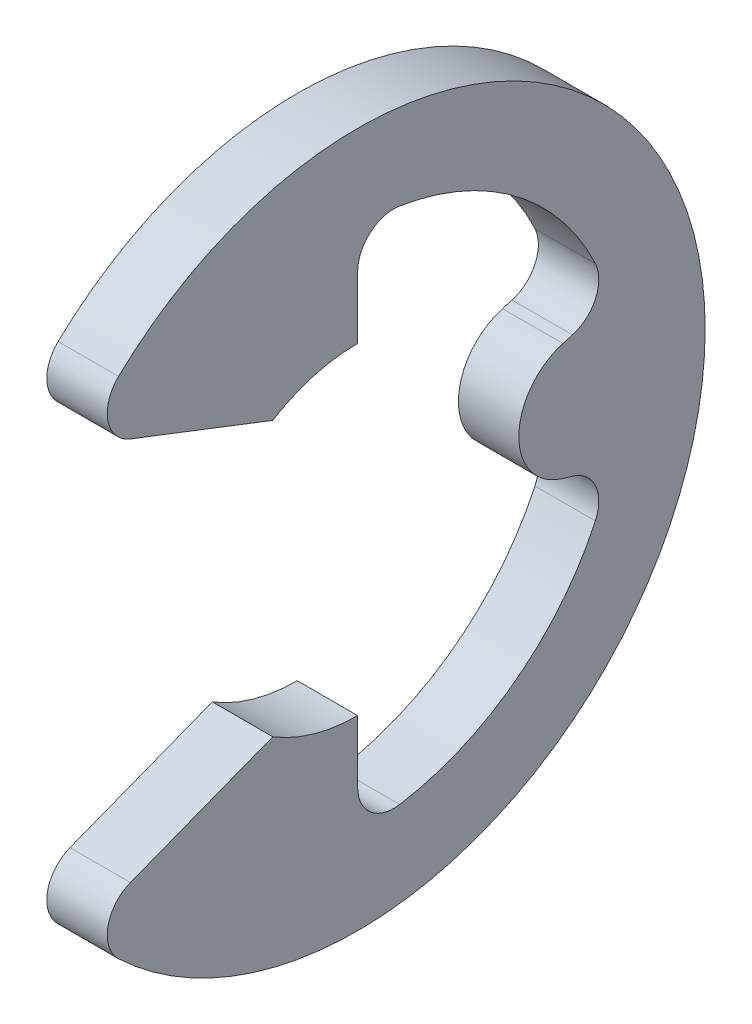
ISO-10303-21;
HEADER;
FILE_DESCRIPTION(('STEP AP214'),'2;1');
FILE_NAME('part.step','',(''),(''),'','','');
FILE_SCHEMA(('AUTOMOTIVE_DESIGN { 1 0 10303 214 1 1 1 1 }'));
ENDSEC;
DATA;
#1=APPLICATION_CONTEXT('core data for automotive mechanical design processes');
#2=APPLICATION_PROTOCOL_DEFINITION('international standard','automotive_design',2000,#1);
#3=PRODUCT_CONTEXT('',#1,'mechanical');
#4=PRODUCT('Part','Part','',(#3));
#5=PRODUCT_RELATED_PRODUCT_CATEGORY('part','',(#4));
#6=PRODUCT_DEFINITION_FORMATION('','',#4);
#7=PRODUCT_DEFINITION_CONTEXT('part definition',#1,'design');
#8=PRODUCT_DEFINITION('design','',#6,#7);
#9=PRODUCT_DEFINITION_SHAPE('','',#8);
#10=(LENGTH_UNIT() NAMED_UNIT(*) SI_UNIT(.MILLI.,.METRE.));
#11=(NAMED_UNIT(*) PLANE_ANGLE_UNIT() SI_UNIT($,.RADIAN.));
#12=(NAMED_UNIT(*) SI_UNIT($,.STERADIAN.) SOLID_ANGLE_UNIT());
#13=UNCERTAINTY_MEASURE_WITH_UNIT(LENGTH_MEASURE(1.E-05),#10,'distance_accuracy_value','');
#14=(GEOMETRIC_REPRESENTATION_CONTEXT(3) GLOBAL_UNCERTAINTY_ASSIGNED_CONTEXT((#13)) GLOBAL_UNIT_ASSIGNED_CONTEXT((#10,
#11,#12)) REPRESENTATION_CONTEXT('',''));
#15=CARTESIAN_POINT('',(0.,0.,0.));
#16=DIRECTION('',(0.,0.,1.));
#17=DIRECTION('',(1.,0.,0.));
#18=AXIS2_PLACEMENT_3D('',#15,#16,#17);
#19=CARTESIAN_POINT('',(0.3,0.,0.));
#20=DIRECTION('',(1.,0.,0.));
#21=DIRECTION('',(0.,0.,-1.));
#22=AXIS2_PLACEMENT_3D('',#19,#20,#21);
#23=PLANE('',#22);
#24=CARTESIAN_POINT('',(0.3,0.,-2.20343572540988));
#25=DIRECTION('',(1.,0.,0.));
#26=DIRECTION('',(0.,0.,-1.));
#27=AXIS2_PLACEMENT_3D('',#24,#25,#26);
#28=CIRCLE('',#27,0.603435725409875);
#29=CARTESIAN_POINT('',(0.3,0.58036589673961,-2.03817804600414));
#30=VERTEX_POINT('',#29);
#31=CARTESIAN_POINT('',(0.3,-0.580365896739609,-2.03817804600414));
#32=VERTEX_POINT('',#31);
#33=EDGE_CURVE('E192',#30,#32,#28,.T.);
#34=ORIENTED_EDGE('',*,*,#33,.T.);
#35=DIRECTION('',(0.,-0.273861278752584,-0.961769203083567));
#36=VECTOR('',#35,1.);
#37=CARTESIAN_POINT('',(0.3,-0.438178046004132,-1.53883072493371));
#38=LINE('',#37,#36);
#39=CARTESIAN_POINT('',(0.3,-0.607265068716835,-2.13264483340097));
#40=VERTEX_POINT('',#39);
#41=EDGE_CURVE('E93',#32,#40,#38,.T.);
#42=ORIENTED_EDGE('',*,*,#41,.T.);
#43=CARTESIAN_POINT('',(0.3,-0.953501981826919,-2.03405477305004));
#44=DIRECTION('',(1.,0.,0.));
#45=DIRECTION('',(0.,0.,-1.));
#46=AXIS2_PLACEMENT_3D('',#43,#44,#45);
#47=CIRCLE('',#46,0.36);
#48=CARTESIAN_POINT('',(0.3,-1.10630327587041,-2.36001759997764));
#49=VERTEX_POINT('',#48);
#50=EDGE_CURVE('E312',#40,#49,#47,.F.);
#51=ORIENTED_EDGE('',*,*,#50,.T.);
#52=CARTESIAN_POINT('',(0.3,0.,0.));
#53=DIRECTION('',(-1.,0.,0.));
#54=DIRECTION('',(0.,0.,-1.));
#55=AXIS2_PLACEMENT_3D('',#52,#53,#54);
#56=CIRCLE('',#55,2.60645161290323);
#57=CARTESIAN_POINT('',(0.3,-2.57276587621173,-0.41769098219414));
#58=VERTEX_POINT('',#57);
#59=EDGE_CURVE('E208',#49,#58,#56,.T.);
#60=ORIENTED_EDGE('',*,*,#59,.T.);
#61=CARTESIAN_POINT('',(0.3,-2.2174185101409,-0.359999999999999));
#62=DIRECTION('',(1.,0.,0.));
#63=DIRECTION('',(0.,0.,-1.));
#64=AXIS2_PLACEMENT_3D('',#61,#62,#63);
#65=CIRCLE('',#64,0.36);
#66=CARTESIAN_POINT('',(0.3,-2.2174185101409,0.));
#67=VERTEX_POINT('',#66);
#68=EDGE_CURVE('E303',#58,#67,#65,.F.);
#69=ORIENTED_EDGE('',*,*,#68,.T.);
#70=DIRECTION('',(0.,1.,0.));
#71=VECTOR('',#70,1.);
#72=CARTESIAN_POINT('',(0.3,-1.6,0.));
#73=LINE('',#72,#71);
#74=CARTESIAN_POINT('',(0.3,-1.6,0.));
#75=VERTEX_POINT('',#74);
#76=EDGE_CURVE('E211',#67,#75,#73,.T.);
#77=ORIENTED_EDGE('',*,*,#76,.T.);
#78=CARTESIAN_POINT('',(0.3,0.,0.));
#79=DIRECTION('',(-1.,0.,0.));
#80=DIRECTION('',(0.,0.,-1.));
#81=AXIS2_PLACEMENT_3D('',#78,#79,#80);
#82=CIRCLE('',#81,1.6);
#83=CARTESIAN_POINT('',(0.3,-1.36,0.84285230022822));
#84=VERTEX_POINT('',#83);
#85=EDGE_CURVE('E218',#75,#84,#82,.T.);
#86=ORIENTED_EDGE('',*,*,#85,.T.);
#87=DIRECTION('',(0.,-0.360953284628375,0.932583897735741));
#88=VECTOR('',#87,1.);
#89=CARTESIAN_POINT('',(0.3,-2.09476781896279,2.74124931092338));
#90=LINE('',#89,#88);
#91=CARTESIAN_POINT('',(0.3,-1.9068472002673,2.25572458927308));
#92=VERTEX_POINT('',#91);
#93=EDGE_CURVE('E220',#84,#92,#90,.T.);
#94=ORIENTED_EDGE('',*,*,#93,.T.);
#95=CARTESIAN_POINT('',(0.3,-2.24257740345216,2.12578140680686));
#96=DIRECTION('',(1.,0.,0.));
#97=DIRECTION('',(0.,0.,-1.));
#98=AXIS2_PLACEMENT_3D('',#95,#96,#97);
#99=CIRCLE('',#98,0.36);
#100=CARTESIAN_POINT('',(0.3,-2.50384855725241,2.37344526002708));
#101=VERTEX_POINT('',#100);
#102=EDGE_CURVE('E292',#92,#101,#99,.T.);
#103=ORIENTED_EDGE('',*,*,#102,.T.);
#104=CARTESIAN_POINT('',(0.3,0.,0.));
#105=DIRECTION('',(1.,0.,0.));
#106=DIRECTION('',(0.,0.,-1.));
#107=AXIS2_PLACEMENT_3D('',#104,#105,#106);
#108=CIRCLE('',#107,3.45);
#109=CARTESIAN_POINT('',(0.3,2.50384855725241,2.37344526002708));
#110=VERTEX_POINT('',#109);
#111=EDGE_CURVE('E252',#101,#110,#108,.T.);
#112=ORIENTED_EDGE('',*,*,#111,.T.);
#113=CARTESIAN_POINT('',(0.3,2.24257740345216,2.12578140680686));
#114=DIRECTION('',(1.,0.,0.));
#115=DIRECTION('',(0.,0.,-1.));
#116=AXIS2_PLACEMENT_3D('',#113,#114,#115);
#117=CIRCLE('',#116,0.36);
#118=CARTESIAN_POINT('',(0.3,1.9068472002673,2.25572458927308));
#119=VERTEX_POINT('',#118);
#120=EDGE_CURVE('E290',#110,#119,#117,.T.);
#121=ORIENTED_EDGE('',*,*,#120,.T.);
#122=DIRECTION('',(0.,-0.360953284628375,-0.932583897735741));
#123=VECTOR('',#122,1.);
#124=CARTESIAN_POINT('',(0.3,2.09476781896279,2.74124931092338));
#125=LINE('',#124,#123);
#126=CARTESIAN_POINT('',(0.3,1.36,0.84285230022822));
#127=VERTEX_POINT('',#126);
#128=EDGE_CURVE('E333',#119,#127,#125,.T.);
#129=ORIENTED_EDGE('',*,*,#128,.T.);
#130=CARTESIAN_POINT('',(0.3,0.,0.));
#131=DIRECTION('',(-1.,0.,0.));
#132=DIRECTION('',(0.,0.,1.));
#133=AXIS2_PLACEMENT_3D('',#130,#131,#132);
#134=CIRCLE('',#133,1.6);
#135=CARTESIAN_POINT('',(0.3,1.6,0.));
#136=VERTEX_POINT('',#135);
#137=EDGE_CURVE('E335',#127,#136,#134,.T.);
#138=ORIENTED_EDGE('',*,*,#137,.T.);
#139=DIRECTION('',(0.,1.,0.));
#140=VECTOR('',#139,1.);
#141=CARTESIAN_POINT('',(0.3,1.6,0.));
#142=LINE('',#141,#140);
#143=CARTESIAN_POINT('',(0.3,2.2174185101409,0.));
#144=VERTEX_POINT('',#143);
#145=EDGE_CURVE('E337',#136,#144,#142,.T.);
#146=ORIENTED_EDGE('',*,*,#145,.T.);
#147=CARTESIAN_POINT('',(0.3,2.2174185101409,-0.359999999999998));
#148=DIRECTION('',(1.,0.,0.));
#149=DIRECTION('',(0.,0.,-1.));
#150=AXIS2_PLACEMENT_3D('',#147,#148,#149);
#151=CIRCLE('',#150,0.36);
#152=CARTESIAN_POINT('',(0.3,2.57276587621173,-0.417690982194139));
#153=VERTEX_POINT('',#152);
#154=EDGE_CURVE('E307',#144,#153,#151,.F.);
#155=ORIENTED_EDGE('',*,*,#154,.T.);
#156=CARTESIAN_POINT('',(0.3,0.,0.));
#157=DIRECTION('',(-1.,0.,0.));
#158=DIRECTION('',(0.,0.,-1.));
#159=AXIS2_PLACEMENT_3D('',#156,#157,#158);
#160=CIRCLE('',#159,2.60645161290323);
#161=CARTESIAN_POINT('',(0.3,1.10630327587041,-2.36001759997764));
#162=VERTEX_POINT('',#161);
#163=EDGE_CURVE('E213',#153,#162,#160,.T.);
#164=ORIENTED_EDGE('',*,*,#163,.T.);
#165=CARTESIAN_POINT('',(0.3,0.95350198182692,-2.03405477305004));
#166=DIRECTION('',(1.,0.,0.));
#167=DIRECTION('',(0.,0.,-1.));
#168=AXIS2_PLACEMENT_3D('',#165,#166,#167);
#169=CIRCLE('',#168,0.36);
#170=CARTESIAN_POINT('',(0.3,0.607265068716836,-2.13264483340097));
#171=VERTEX_POINT('',#170);
#172=EDGE_CURVE('E12',#162,#171,#169,.F.);
#173=ORIENTED_EDGE('',*,*,#172,.T.);
#174=DIRECTION('',(0.,-0.273861278752584,0.961769203083567));
#175=VECTOR('',#174,1.);
#176=CARTESIAN_POINT('',(0.3,0.438178046004133,-1.53883072493371));
#177=LINE('',#176,#175);
#178=EDGE_CURVE('E195',#171,#30,#177,.T.);
#179=ORIENTED_EDGE('',*,*,#178,.T.);
#180=EDGE_LOOP('',(#34,#42,#51,#60,#69,#77,#86,#94,#103,#112,#121,#129,#138,#146,#155,#164,#173,#179));
#181=FACE_BOUND('',#180,.T.);
#182=ADVANCED_FACE('F70',(#181),#23,.T.);
#183=CARTESIAN_POINT('',(-0.3,0.,0.));
#184=DIRECTION('',(1.,0.,0.));
#185=DIRECTION('',(0.,0.,-1.));
#186=AXIS2_PLACEMENT_3D('',#183,#184,#185);
#187=PLANE('',#186);
#188=DIRECTION('',(0.,-0.273861278752584,-0.961769203083567));
#189=VECTOR('',#188,1.);
#190=CARTESIAN_POINT('',(-0.3,-0.438178046004132,-1.53883072493371));
#191=LINE('',#190,#189);
#192=CARTESIAN_POINT('',(-0.3,-0.580365896739609,-2.03817804600414));
#193=VERTEX_POINT('',#192);
#194=CARTESIAN_POINT('',(-0.3,-0.607265068716835,-2.13264483340097));
#195=VERTEX_POINT('',#194);
#196=EDGE_CURVE('E240',#193,#195,#191,.T.);
#197=ORIENTED_EDGE('',*,*,#196,.F.);
#198=CARTESIAN_POINT('',(-0.3,0.,-2.20343572540988));
#199=DIRECTION('',(1.,0.,0.));
#200=DIRECTION('',(0.,0.,-1.));
#201=AXIS2_PLACEMENT_3D('',#198,#199,#200);
#202=CIRCLE('',#201,0.603435725409875);
#203=CARTESIAN_POINT('',(-0.3,0.580365896739609,-2.03817804600414));
#204=VERTEX_POINT('',#203);
#205=EDGE_CURVE('E196',#204,#193,#202,.T.);
#206=ORIENTED_EDGE('',*,*,#205,.F.);
#207=DIRECTION('',(0.,-0.273861278752584,0.961769203083567));
#208=VECTOR('',#207,1.);
#209=CARTESIAN_POINT('',(-0.3,0.438178046004133,-1.53883072493371));
#210=LINE('',#209,#208);
#211=CARTESIAN_POINT('',(-0.3,0.607265068716836,-2.13264483340097));
#212=VERTEX_POINT('',#211);
#213=EDGE_CURVE('E237',#212,#204,#210,.T.);
#214=ORIENTED_EDGE('',*,*,#213,.F.);
#215=CARTESIAN_POINT('',(-0.3,0.95350198182692,-2.03405477305004));
#216=DIRECTION('',(1.,0.,0.));
#217=DIRECTION('',(0.,0.,-1.));
#218=AXIS2_PLACEMENT_3D('',#215,#216,#217);
#219=CIRCLE('',#218,0.36);
#220=CARTESIAN_POINT('',(-0.3,1.10630327587041,-2.36001759997764));
#221=VERTEX_POINT('',#220);
#222=EDGE_CURVE('E78',#212,#221,#219,.T.);
#223=ORIENTED_EDGE('',*,*,#222,.T.);
#224=CARTESIAN_POINT('',(-0.3,0.,0.));
#225=DIRECTION('',(-1.,0.,0.));
#226=DIRECTION('',(0.,0.,-1.));
#227=AXIS2_PLACEMENT_3D('',#224,#225,#226);
#228=CIRCLE('',#227,2.60645161290323);
#229=CARTESIAN_POINT('',(-0.3,2.57276587621173,-0.417690982194139));
#230=VERTEX_POINT('',#229);
#231=EDGE_CURVE('E234',#230,#221,#228,.T.);
#232=ORIENTED_EDGE('',*,*,#231,.F.);
#233=CARTESIAN_POINT('',(-0.3,2.2174185101409,-0.359999999999998));
#234=DIRECTION('',(1.,0.,0.));
#235=DIRECTION('',(0.,0.,-1.));
#236=AXIS2_PLACEMENT_3D('',#233,#234,#235);
#237=CIRCLE('',#236,0.36);
#238=CARTESIAN_POINT('',(-0.3,2.2174185101409,0.));
#239=VERTEX_POINT('',#238);
#240=EDGE_CURVE('E305',#230,#239,#237,.T.);
#241=ORIENTED_EDGE('',*,*,#240,.T.);
#242=DIRECTION('',(0.,1.,0.));
#243=VECTOR('',#242,1.);
#244=CARTESIAN_POINT('',(-0.3,1.6,0.));
#245=LINE('',#244,#243);
#246=CARTESIAN_POINT('',(-0.3,1.6,0.));
#247=VERTEX_POINT('',#246);
#248=EDGE_CURVE('E231',#247,#239,#245,.T.);
#249=ORIENTED_EDGE('',*,*,#248,.F.);
#250=CARTESIAN_POINT('',(-0.3,0.,0.));
#251=DIRECTION('',(-1.,0.,0.));
#252=DIRECTION('',(0.,0.,1.));
#253=AXIS2_PLACEMENT_3D('',#250,#251,#252);
#254=CIRCLE('',#253,1.6);
#255=CARTESIAN_POINT('',(-0.3,1.36,0.84285230022822));
#256=VERTEX_POINT('',#255);
#257=EDGE_CURVE('E229',#256,#247,#254,.T.);
#258=ORIENTED_EDGE('',*,*,#257,.F.);
#259=DIRECTION('',(0.,-0.360953284628375,-0.932583897735741));
#260=VECTOR('',#259,1.);
#261=CARTESIAN_POINT('',(-0.3,2.09476781896279,2.74124931092338));
#262=LINE('',#261,#260);
#263=CARTESIAN_POINT('',(-0.3,1.9068472002673,2.25572458927308));
#264=VERTEX_POINT('',#263);
#265=EDGE_CURVE('E227',#264,#256,#262,.T.);
#266=ORIENTED_EDGE('',*,*,#265,.F.);
#267=CARTESIAN_POINT('',(-0.3,2.24257740345216,2.12578140680686));
#268=DIRECTION('',(1.,0.,0.));
#269=DIRECTION('',(0.,0.,-1.));
#270=AXIS2_PLACEMENT_3D('',#267,#268,#269);
#271=CIRCLE('',#270,0.36);
#272=CARTESIAN_POINT('',(-0.3,2.50384855725241,2.37344526002708));
#273=VERTEX_POINT('',#272);
#274=EDGE_CURVE('E284',#264,#273,#271,.F.);
#275=ORIENTED_EDGE('',*,*,#274,.T.);
#276=CARTESIAN_POINT('',(-0.3,0.,0.));
#277=DIRECTION('',(1.,0.,0.));
#278=DIRECTION('',(0.,0.,-1.));
#279=AXIS2_PLACEMENT_3D('',#276,#277,#278);
#280=CIRCLE('',#279,3.45);
#281=CARTESIAN_POINT('',(-0.3,-2.50384855725241,2.37344526002708));
#282=VERTEX_POINT('',#281);
#283=EDGE_CURVE('E224',#282,#273,#280,.T.);
#284=ORIENTED_EDGE('',*,*,#283,.F.);
#285=CARTESIAN_POINT('',(-0.3,-2.24257740345216,2.12578140680686));
#286=DIRECTION('',(1.,0.,0.));
#287=DIRECTION('',(0.,0.,-1.));
#288=AXIS2_PLACEMENT_3D('',#285,#286,#287);
#289=CIRCLE('',#288,0.36);
#290=CARTESIAN_POINT('',(-0.3,-1.9068472002673,2.25572458927308));
#291=VERTEX_POINT('',#290);
#292=EDGE_CURVE('E286',#282,#291,#289,.F.);
#293=ORIENTED_EDGE('',*,*,#292,.T.);
#294=DIRECTION('',(0.,-0.360953284628375,0.932583897735741));
#295=VECTOR('',#294,1.);
#296=CARTESIAN_POINT('',(-0.3,-2.09476781896279,2.74124931092338));
#297=LINE('',#296,#295);
#298=CARTESIAN_POINT('',(-0.3,-1.36,0.84285230022822));
#299=VERTEX_POINT('',#298);
#300=EDGE_CURVE('E249',#299,#291,#297,.T.);
#301=ORIENTED_EDGE('',*,*,#300,.F.);
#302=CARTESIAN_POINT('',(-0.3,0.,0.));
#303=DIRECTION('',(-1.,0.,0.));
#304=DIRECTION('',(0.,0.,-1.));
#305=AXIS2_PLACEMENT_3D('',#302,#303,#304);
#306=CIRCLE('',#305,1.6);
#307=CARTESIAN_POINT('',(-0.3,-1.6,0.));
#308=VERTEX_POINT('',#307);
#309=EDGE_CURVE('E247',#308,#299,#306,.T.);
#310=ORIENTED_EDGE('',*,*,#309,.F.);
#311=DIRECTION('',(0.,1.,0.));
#312=VECTOR('',#311,1.);
#313=CARTESIAN_POINT('',(-0.3,-1.6,0.));
#314=LINE('',#313,#312);
#315=CARTESIAN_POINT('',(-0.3,-2.2174185101409,0.));
#316=VERTEX_POINT('',#315);
#317=EDGE_CURVE('E245',#316,#308,#314,.T.);
#318=ORIENTED_EDGE('',*,*,#317,.F.);
#319=CARTESIAN_POINT('',(-0.3,-2.2174185101409,-0.359999999999999));
#320=DIRECTION('',(1.,0.,0.));
#321=DIRECTION('',(0.,0.,-1.));
#322=AXIS2_PLACEMENT_3D('',#319,#320,#321);
#323=CIRCLE('',#322,0.36);
#324=CARTESIAN_POINT('',(-0.3,-2.57276587621173,-0.41769098219414));
#325=VERTEX_POINT('',#324);
#326=EDGE_CURVE('E301',#316,#325,#323,.T.);
#327=ORIENTED_EDGE('',*,*,#326,.T.);
#328=CARTESIAN_POINT('',(-0.3,0.,0.));
#329=DIRECTION('',(-1.,0.,0.));
#330=DIRECTION('',(0.,0.,-1.));
#331=AXIS2_PLACEMENT_3D('',#328,#329,#330);
#332=CIRCLE('',#331,2.60645161290323);
#333=CARTESIAN_POINT('',(-0.3,-1.10630327587041,-2.36001759997764));
#334=VERTEX_POINT('',#333);
#335=EDGE_CURVE('E242',#334,#325,#332,.T.);
#336=ORIENTED_EDGE('',*,*,#335,.F.);
#337=CARTESIAN_POINT('',(-0.3,-0.953501981826919,-2.03405477305004));
#338=DIRECTION('',(1.,0.,0.));
#339=DIRECTION('',(0.,0.,-1.));
#340=AXIS2_PLACEMENT_3D('',#337,#338,#339);
#341=CIRCLE('',#340,0.36);
#342=EDGE_CURVE('E309',#334,#195,#341,.T.);
#343=ORIENTED_EDGE('',*,*,#342,.T.);
#344=EDGE_LOOP('',(#197,#206,#214,#223,#232,#241,#249,#258,#266,#275,#284,#293,#301,#310,#318,
#327,#336,#343));
#345=FACE_BOUND('',#344,.T.);
#346=ADVANCED_FACE('F316',(#345),#187,.F.);
#347=CARTESIAN_POINT('',(0.3,-0.438178046004132,-1.53883072493371));
#348=DIRECTION('',(0.,0.961769203083567,-0.273861278752584));
#349=DIRECTION('',(0.,0.273861278752584,0.961769203083567));
#350=AXIS2_PLACEMENT_3D('',#347,#348,#349);
#351=PLANE('',#350);
#352=DIRECTION('',(1.,0.,0.));
#353=VECTOR('',#352,1.);
#354=CARTESIAN_POINT('',(-0.3,-0.580365896739609,-2.03817804600414));
#355=LINE('',#354,#353);
#356=EDGE_CURVE('E197',#193,#32,#355,.T.);
#357=ORIENTED_EDGE('',*,*,#356,.F.);
#358=ORIENTED_EDGE('',*,*,#196,.T.);
#359=DIRECTION('',(1.,0.,0.));
#360=VECTOR('',#359,1.);
#361=CARTESIAN_POINT('',(0.3,-0.607265068716835,-2.13264483340097));
#362=LINE('',#361,#360);
#363=EDGE_CURVE('E206',#195,#40,#362,.T.);
#364=ORIENTED_EDGE('',*,*,#363,.T.);
#365=ORIENTED_EDGE('',*,*,#41,.F.);
#366=EDGE_LOOP('',(#357,#358,#364,#365));
#367=FACE_BOUND('',#366,.T.);
#368=ADVANCED_FACE('F204',(#367),#351,.F.);
#369=CARTESIAN_POINT('',(0.3,0.,0.));
#370=DIRECTION('',(-1.,0.,0.));
#371=DIRECTION('',(0.,0.,1.));
#372=AXIS2_PLACEMENT_3D('',#369,#370,#371);
#373=CYLINDRICAL_SURFACE('',#372,3.45);
#374=ORIENTED_EDGE('',*,*,#111,.F.);
#375=DIRECTION('',(-1.,0.,0.));
#376=VECTOR('',#375,1.);
#377=CARTESIAN_POINT('',(0.3,-2.50384855725241,2.37344526002708));
#378=LINE('',#377,#376);
#379=EDGE_CURVE('E281',#101,#282,#378,.T.);
#380=ORIENTED_EDGE('',*,*,#379,.T.);
#381=ORIENTED_EDGE('',*,*,#283,.T.);
#382=DIRECTION('',(-1.,0.,0.));
#383=VECTOR('',#382,1.);
#384=CARTESIAN_POINT('',(0.3,2.50384855725241,2.37344526002708));
#385=LINE('',#384,#383);
#386=EDGE_CURVE('E279',#273,#110,#385,.F.);
#387=ORIENTED_EDGE('',*,*,#386,.T.);
#388=EDGE_LOOP('',(#374,#380,#381,#387));
#389=FACE_BOUND('',#388,.T.);
#390=ADVANCED_FACE('F365',(#389),#373,.T.);
#391=CARTESIAN_POINT('',(0.3,2.09476781896279,2.74124931092338));
#392=DIRECTION('',(0.,0.932583897735741,-0.360953284628375));
#393=DIRECTION('',(0.,0.360953284628375,0.932583897735741));
#394=AXIS2_PLACEMENT_3D('',#391,#392,#393);
#395=PLANE('',#394);
#396=ORIENTED_EDGE('',*,*,#128,.F.);
#397=DIRECTION('',(-1.,0.,0.));
#398=VECTOR('',#397,1.);
#399=CARTESIAN_POINT('',(0.3,1.9068472002673,2.25572458927308));
#400=LINE('',#399,#398);
#401=EDGE_CURVE('E294',#119,#264,#400,.T.);
#402=ORIENTED_EDGE('',*,*,#401,.T.);
#403=ORIENTED_EDGE('',*,*,#265,.T.);
#404=DIRECTION('',(-1.,0.,0.));
#405=VECTOR('',#404,1.);
#406=CARTESIAN_POINT('',(0.3,1.36,0.84285230022822));
#407=LINE('',#406,#405);
#408=EDGE_CURVE('E261',#127,#256,#407,.T.);
#409=ORIENTED_EDGE('',*,*,#408,.F.);
#410=EDGE_LOOP('',(#396,#402,#403,#409));
#411=FACE_BOUND('',#410,.T.);
#412=ADVANCED_FACE('F357',(#411),#395,.F.);
#413=CARTESIAN_POINT('',(0.3,0.,0.));
#414=DIRECTION('',(-1.,0.,0.));
#415=DIRECTION('',(0.,0.,1.));
#416=AXIS2_PLACEMENT_3D('',#413,#414,#415);
#417=CYLINDRICAL_SURFACE('',#416,1.6);
#418=ORIENTED_EDGE('',*,*,#257,.T.);
#419=DIRECTION('',(-1.,0.,0.));
#420=VECTOR('',#419,1.);
#421=CARTESIAN_POINT('',(0.3,1.6,0.));
#422=LINE('',#421,#420);
#423=EDGE_CURVE('E258',#136,#247,#422,.T.);
#424=ORIENTED_EDGE('',*,*,#423,.F.);
#425=ORIENTED_EDGE('',*,*,#137,.F.);
#426=ORIENTED_EDGE('',*,*,#408,.T.);
#427=EDGE_LOOP('',(#418,#424,#425,#426));
#428=FACE_BOUND('',#427,.T.);
#429=ADVANCED_FACE('F351',(#428),#417,.F.);
#430=CARTESIAN_POINT('',(0.3,1.6,0.));
#431=DIRECTION('',(0.,0.,1.));
#432=DIRECTION('',(0.,-1.,0.));
#433=AXIS2_PLACEMENT_3D('',#430,#431,#432);
#434=PLANE('',#433);
#435=ORIENTED_EDGE('',*,*,#248,.T.);
#436=DIRECTION('',(1.,0.,0.));
#437=VECTOR('',#436,1.);
#438=CARTESIAN_POINT('',(0.3,2.2174185101409,0.));
#439=LINE('',#438,#437);
#440=EDGE_CURVE('E277',#239,#144,#439,.T.);
#441=ORIENTED_EDGE('',*,*,#440,.T.);
#442=ORIENTED_EDGE('',*,*,#145,.F.);
#443=ORIENTED_EDGE('',*,*,#423,.T.);
#444=EDGE_LOOP('',(#435,#441,#442,#443));
#445=FACE_BOUND('',#444,.T.);
#446=ADVANCED_FACE('F349',(#445),#434,.F.);
#447=CARTESIAN_POINT('',(0.3,0.,0.));
#448=DIRECTION('',(-1.,0.,0.));
#449=DIRECTION('',(0.,0.,1.));
#450=AXIS2_PLACEMENT_3D('',#447,#448,#449);
#451=CYLINDRICAL_SURFACE('',#450,2.60645161290323);
#452=ORIENTED_EDGE('',*,*,#163,.F.);
#453=DIRECTION('',(-1.,0.,0.));
#454=VECTOR('',#453,1.);
#455=CARTESIAN_POINT('',(0.3,2.57276587621173,-0.417690982194139));
#456=LINE('',#455,#454);
#457=EDGE_CURVE('E274',#153,#230,#456,.T.);
#458=ORIENTED_EDGE('',*,*,#457,.T.);
#459=ORIENTED_EDGE('',*,*,#231,.T.);
#460=DIRECTION('',(-1.,0.,0.));
#461=VECTOR('',#460,1.);
#462=CARTESIAN_POINT('',(0.3,1.10630327587041,-2.36001759997764));
#463=LINE('',#462,#461);
#464=EDGE_CURVE('E272',#221,#162,#463,.F.);
#465=ORIENTED_EDGE('',*,*,#464,.T.);
#466=EDGE_LOOP('',(#452,#458,#459,#465));
#467=FACE_BOUND('',#466,.T.);
#468=ADVANCED_FACE('F322',(#467),#451,.F.);
#469=CARTESIAN_POINT('',(0.3,0.438178046004133,-1.53883072493371));
#470=DIRECTION('',(0.,-0.961769203083567,-0.273861278752584));
#471=DIRECTION('',(0.,0.273861278752584,-0.961769203083567));
#472=AXIS2_PLACEMENT_3D('',#469,#470,#471);
#473=PLANE('',#472);
#474=ORIENTED_EDGE('',*,*,#213,.T.);
#475=DIRECTION('',(1.,0.,0.));
#476=VECTOR('',#475,1.);
#477=CARTESIAN_POINT('',(-0.3,0.58036589673961,-2.03817804600414));
#478=LINE('',#477,#476);
#479=EDGE_CURVE('E85',#204,#30,#478,.T.);
#480=ORIENTED_EDGE('',*,*,#479,.T.);
#481=ORIENTED_EDGE('',*,*,#178,.F.);
#482=DIRECTION('',(1.,0.,0.));
#483=VECTOR('',#482,1.);
#484=CARTESIAN_POINT('',(-0.3,0.607265068716836,-2.13264483340097));
#485=LINE('',#484,#483);
#486=EDGE_CURVE('E298',#171,#212,#485,.F.);
#487=ORIENTED_EDGE('',*,*,#486,.T.);
#488=EDGE_LOOP('',(#474,#480,#481,#487));
#489=FACE_BOUND('',#488,.T.);
#490=ADVANCED_FACE('F327',(#489),#473,.F.);
#491=CARTESIAN_POINT('',(0.3,0.,0.));
#492=DIRECTION('',(-1.,0.,0.));
#493=DIRECTION('',(0.,0.,1.));
#494=AXIS2_PLACEMENT_3D('',#491,#492,#493);
#495=CYLINDRICAL_SURFACE('',#494,2.60645161290323);
#496=ORIENTED_EDGE('',*,*,#335,.T.);
#497=DIRECTION('',(-1.,0.,0.));
#498=VECTOR('',#497,1.);
#499=CARTESIAN_POINT('',(0.3,-2.57276587621173,-0.41769098219414));
#500=LINE('',#499,#498);
#501=EDGE_CURVE('E270',#325,#58,#500,.F.);
#502=ORIENTED_EDGE('',*,*,#501,.T.);
#503=ORIENTED_EDGE('',*,*,#59,.F.);
#504=DIRECTION('',(-1.,0.,0.));
#505=VECTOR('',#504,1.);
#506=CARTESIAN_POINT('',(0.3,-1.10630327587041,-2.36001759997764));
#507=LINE('',#506,#505);
#508=EDGE_CURVE('E267',#49,#334,#507,.T.);
#509=ORIENTED_EDGE('',*,*,#508,.T.);
#510=EDGE_LOOP('',(#496,#502,#503,#509));
#511=FACE_BOUND('',#510,.T.);
#512=ADVANCED_FACE('F393',(#511),#495,.F.);
#513=CARTESIAN_POINT('',(0.3,-1.6,0.));
#514=DIRECTION('',(0.,0.,1.));
#515=DIRECTION('',(0.,-1.,0.));
#516=AXIS2_PLACEMENT_3D('',#513,#514,#515);
#517=PLANE('',#516);
#518=ORIENTED_EDGE('',*,*,#76,.F.);
#519=DIRECTION('',(1.,0.,0.));
#520=VECTOR('',#519,1.);
#521=CARTESIAN_POINT('',(-0.3,-2.2174185101409,0.));
#522=LINE('',#521,#520);
#523=EDGE_CURVE('E264',#67,#316,#522,.F.);
#524=ORIENTED_EDGE('',*,*,#523,.T.);
#525=ORIENTED_EDGE('',*,*,#317,.T.);
#526=DIRECTION('',(-1.,0.,0.));
#527=VECTOR('',#526,1.);
#528=CARTESIAN_POINT('',(0.3,-1.6,0.));
#529=LINE('',#528,#527);
#530=EDGE_CURVE('E255',#75,#308,#529,.T.);
#531=ORIENTED_EDGE('',*,*,#530,.F.);
#532=EDGE_LOOP('',(#518,#524,#525,#531));
#533=FACE_BOUND('',#532,.T.);
#534=ADVANCED_FACE('F385',(#533),#517,.F.);
#535=CARTESIAN_POINT('',(0.3,0.,0.));
#536=DIRECTION('',(-1.,0.,0.));
#537=DIRECTION('',(0.,0.,1.));
#538=AXIS2_PLACEMENT_3D('',#535,#536,#537);
#539=CYLINDRICAL_SURFACE('',#538,1.6);
#540=ORIENTED_EDGE('',*,*,#309,.T.);
#541=DIRECTION('',(-1.,0.,0.));
#542=VECTOR('',#541,1.);
#543=CARTESIAN_POINT('',(0.3,-1.36,0.84285230022822));
#544=LINE('',#543,#542);
#545=EDGE_CURVE('E223',#84,#299,#544,.T.);
#546=ORIENTED_EDGE('',*,*,#545,.F.);
#547=ORIENTED_EDGE('',*,*,#85,.F.);
#548=ORIENTED_EDGE('',*,*,#530,.T.);
#549=EDGE_LOOP('',(#540,#546,#547,#548));
#550=FACE_BOUND('',#549,.T.);
#551=ADVANCED_FACE('F379',(#550),#539,.F.);
#552=CARTESIAN_POINT('',(0.3,-2.09476781896279,2.74124931092338));
#553=DIRECTION('',(0.,-0.932583897735741,-0.360953284628375));
#554=DIRECTION('',(0.,0.360953284628375,-0.932583897735741));
#555=AXIS2_PLACEMENT_3D('',#552,#553,#554);
#556=PLANE('',#555);
#557=ORIENTED_EDGE('',*,*,#300,.T.);
#558=DIRECTION('',(-1.,0.,0.));
#559=VECTOR('',#558,1.);
#560=CARTESIAN_POINT('',(0.3,-1.9068472002673,2.25572458927308));
#561=LINE('',#560,#559);
#562=EDGE_CURVE('E288',#291,#92,#561,.F.);
#563=ORIENTED_EDGE('',*,*,#562,.T.);
#564=ORIENTED_EDGE('',*,*,#93,.F.);
#565=ORIENTED_EDGE('',*,*,#545,.T.);
#566=EDGE_LOOP('',(#557,#563,#564,#565));
#567=FACE_BOUND('',#566,.T.);
#568=ADVANCED_FACE('F375',(#567),#556,.F.);
#569=CARTESIAN_POINT('',(0.3,-2.2174185101409,-0.359999999999999));
#570=DIRECTION('',(-1.,0.,0.));
#571=DIRECTION('',(0.,0.,1.));
#572=AXIS2_PLACEMENT_3D('',#569,#570,#571);
#573=CYLINDRICAL_SURFACE('',#572,0.36);
#574=ORIENTED_EDGE('',*,*,#68,.F.);
#575=ORIENTED_EDGE('',*,*,#501,.F.);
#576=ORIENTED_EDGE('',*,*,#326,.F.);
#577=ORIENTED_EDGE('',*,*,#523,.F.);
#578=EDGE_LOOP('',(#574,#575,#576,#577));
#579=FACE_BOUND('',#578,.T.);
#580=ADVANCED_FACE('F389',(#579),#573,.F.);
#581=CARTESIAN_POINT('',(0.3,2.2174185101409,-0.359999999999998));
#582=DIRECTION('',(-1.,0.,0.));
#583=DIRECTION('',(0.,0.,1.));
#584=AXIS2_PLACEMENT_3D('',#581,#582,#583);
#585=CYLINDRICAL_SURFACE('',#584,0.36);
#586=ORIENTED_EDGE('',*,*,#154,.F.);
#587=ORIENTED_EDGE('',*,*,#440,.F.);
#588=ORIENTED_EDGE('',*,*,#240,.F.);
#589=ORIENTED_EDGE('',*,*,#457,.F.);
#590=EDGE_LOOP('',(#586,#587,#588,#589));
#591=FACE_BOUND('',#590,.T.);
#592=ADVANCED_FACE('F346',(#591),#585,.F.);
#593=CARTESIAN_POINT('',(0.3,-2.24257740345216,2.12578140680686));
#594=DIRECTION('',(-1.,0.,0.));
#595=DIRECTION('',(0.,0.,1.));
#596=AXIS2_PLACEMENT_3D('',#593,#594,#595);
#597=CYLINDRICAL_SURFACE('',#596,0.36);
#598=ORIENTED_EDGE('',*,*,#102,.F.);
#599=ORIENTED_EDGE('',*,*,#562,.F.);
#600=ORIENTED_EDGE('',*,*,#292,.F.);
#601=ORIENTED_EDGE('',*,*,#379,.F.);
#602=EDGE_LOOP('',(#598,#599,#600,#601));
#603=FACE_BOUND('',#602,.T.);
#604=ADVANCED_FACE('F371',(#603),#597,.T.);
#605=CARTESIAN_POINT('',(0.3,2.24257740345216,2.12578140680686));
#606=DIRECTION('',(-1.,0.,0.));
#607=DIRECTION('',(0.,0.,1.));
#608=AXIS2_PLACEMENT_3D('',#605,#606,#607);
#609=CYLINDRICAL_SURFACE('',#608,0.36);
#610=ORIENTED_EDGE('',*,*,#120,.F.);
#611=ORIENTED_EDGE('',*,*,#386,.F.);
#612=ORIENTED_EDGE('',*,*,#274,.F.);
#613=ORIENTED_EDGE('',*,*,#401,.F.);
#614=EDGE_LOOP('',(#610,#611,#612,#613));
#615=FACE_BOUND('',#614,.T.);
#616=ADVANCED_FACE('F361',(#615),#609,.T.);
#617=CARTESIAN_POINT('',(0.3,-0.953501981826919,-2.03405477305004));
#618=DIRECTION('',(-1.,0.,0.));
#619=DIRECTION('',(0.,0.,1.));
#620=AXIS2_PLACEMENT_3D('',#617,#618,#619);
#621=CYLINDRICAL_SURFACE('',#620,0.36);
#622=ORIENTED_EDGE('',*,*,#50,.F.);
#623=ORIENTED_EDGE('',*,*,#363,.F.);
#624=ORIENTED_EDGE('',*,*,#342,.F.);
#625=ORIENTED_EDGE('',*,*,#508,.F.);
#626=EDGE_LOOP('',(#622,#623,#624,#625));
#627=FACE_BOUND('',#626,.T.);
#628=ADVANCED_FACE('F396',(#627),#621,.F.);
#629=CARTESIAN_POINT('',(0.3,0.95350198182692,-2.03405477305004));
#630=DIRECTION('',(-1.,0.,0.));
#631=DIRECTION('',(0.,0.,1.));
#632=AXIS2_PLACEMENT_3D('',#629,#630,#631);
#633=CYLINDRICAL_SURFACE('',#632,0.36);
#634=ORIENTED_EDGE('',*,*,#172,.F.);
#635=ORIENTED_EDGE('',*,*,#464,.F.);
#636=ORIENTED_EDGE('',*,*,#222,.F.);
#637=ORIENTED_EDGE('',*,*,#486,.F.);
#638=EDGE_LOOP('',(#634,#635,#636,#637));
#639=FACE_BOUND('',#638,.T.);
#640=ADVANCED_FACE('F72',(#639),#633,.F.);
#641=CARTESIAN_POINT('',(-0.3,0.,-2.20343572540988));
#642=DIRECTION('',(1.,0.,0.));
#643=DIRECTION('',(0.,0.,-1.));
#644=AXIS2_PLACEMENT_3D('',#641,#642,#643);
#645=CYLINDRICAL_SURFACE('',#644,0.603435725409875);
#646=ORIENTED_EDGE('',*,*,#479,.F.);
#647=ORIENTED_EDGE('',*,*,#205,.T.);
#648=ORIENTED_EDGE('',*,*,#356,.T.);
#649=ORIENTED_EDGE('',*,*,#33,.F.);
#650=EDGE_LOOP('',(#646,#647,#648,#649));
#651=FACE_BOUND('',#650,.T.);
#652=ADVANCED_FACE('F200',(#651),#645,.T.);
#653=CLOSED_SHELL('',(#182,#346,#368,#390,#412,#429,#446,#468,#490,#512,#534,#551,#568,#580,
#592,#604,#616,#628,#640,#652));
#654=MANIFOLD_SOLID_BREP('B2',#653);
#655=ADVANCED_BREP_SHAPE_REPRESENTATION('',(#18,#654),#14);
#656=SHAPE_DEFINITION_REPRESENTATION(#9,#655);
ENDSEC;
END-ISO-10303-21;
